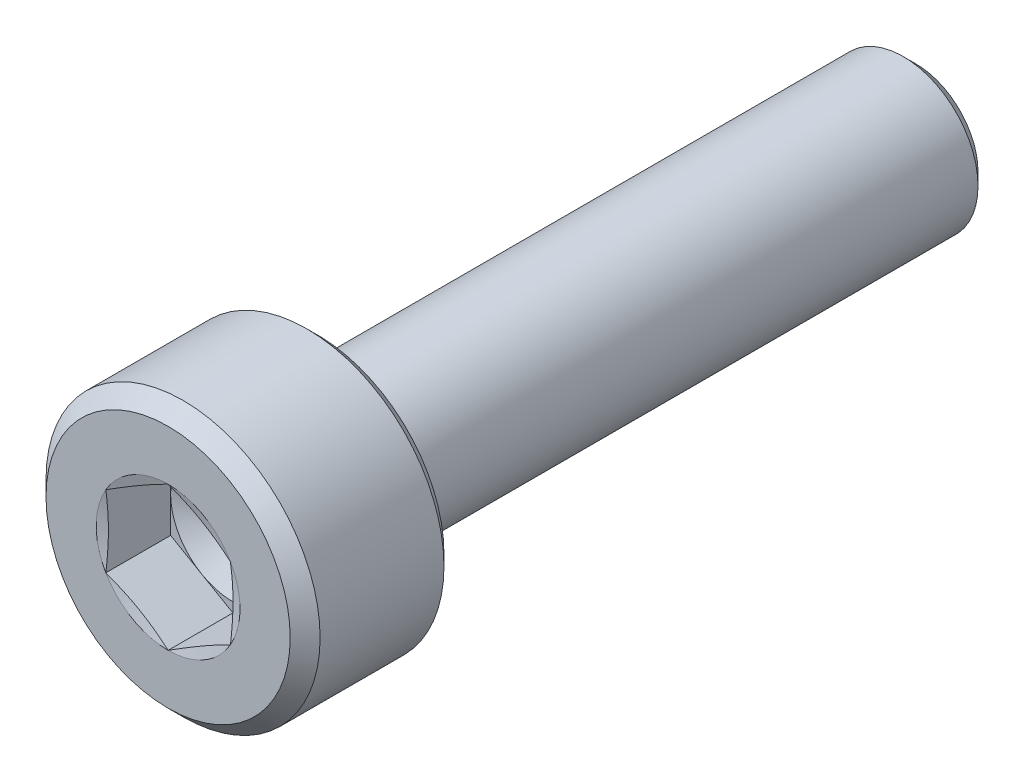
ISO-10303-21;
HEADER;
FILE_DESCRIPTION(('STEP AP214'),'2;1');
FILE_NAME('part.step','',(''),(''),'','','');
FILE_SCHEMA(('AUTOMOTIVE_DESIGN { 1 0 10303 214 1 1 1 1 }'));
ENDSEC;
DATA;
#1=APPLICATION_CONTEXT('core data for automotive mechanical design processes');
#2=APPLICATION_PROTOCOL_DEFINITION('international standard','automotive_design',2000,#1);
#3=PRODUCT_CONTEXT('',#1,'mechanical');
#4=PRODUCT('Part','Part','',(#3));
#5=PRODUCT_RELATED_PRODUCT_CATEGORY('part','',(#4));
#6=PRODUCT_DEFINITION_FORMATION('','',#4);
#7=PRODUCT_DEFINITION_CONTEXT('part definition',#1,'design');
#8=PRODUCT_DEFINITION('design','',#6,#7);
#9=PRODUCT_DEFINITION_SHAPE('','',#8);
#10=(LENGTH_UNIT() NAMED_UNIT(*) SI_UNIT(.MILLI.,.METRE.));
#11=(NAMED_UNIT(*) PLANE_ANGLE_UNIT() SI_UNIT($,.RADIAN.));
#12=(NAMED_UNIT(*) SI_UNIT($,.STERADIAN.) SOLID_ANGLE_UNIT());
#13=UNCERTAINTY_MEASURE_WITH_UNIT(LENGTH_MEASURE(1.E-05),#10,'distance_accuracy_value','');
#14=(GEOMETRIC_REPRESENTATION_CONTEXT(3) GLOBAL_UNCERTAINTY_ASSIGNED_CONTEXT((#13)) GLOBAL_UNIT_ASSIGNED_CONTEXT((#10,
#11,#12)) REPRESENTATION_CONTEXT('',''));
#15=CARTESIAN_POINT('',(0.,0.,0.));
#16=DIRECTION('',(0.,0.,1.));
#17=DIRECTION('',(1.,0.,0.));
#18=AXIS2_PLACEMENT_3D('',#15,#16,#17);
#19=CARTESIAN_POINT('',(0.,0.,0.));
#20=DIRECTION('',(0.,0.,-1.));
#21=DIRECTION('',(-1.,0.,0.));
#22=AXIS2_PLACEMENT_3D('',#19,#20,#21);
#23=PLANE('',#22);
#24=CARTESIAN_POINT('',(0.,0.,0.));
#25=DIRECTION('',(0.,0.,1.));
#26=DIRECTION('',(1.,0.,0.));
#27=AXIS2_PLACEMENT_3D('',#24,#25,#26);
#28=CIRCLE('',#27,2.44999999999999);
#29=CARTESIAN_POINT('',(2.44999999999999,0.,0.));
#30=VERTEX_POINT('',#29);
#31=EDGE_CURVE('E229',#30,#30,#28,.T.);
#32=ORIENTED_EDGE('',*,*,#31,.T.);
#33=EDGE_LOOP('',(#32));
#34=FACE_BOUND('',#33,.T.);
#35=CARTESIAN_POINT('',(0.,0.,0.));
#36=DIRECTION('',(0.,0.,1.));
#37=DIRECTION('',(1.,0.,0.));
#38=AXIS2_PLACEMENT_3D('',#35,#36,#37);
#39=CIRCLE('',#38,1.44337567297407);
#40=CARTESIAN_POINT('',(-1.25,-0.721687836487033,0.));
#41=VERTEX_POINT('',#40);
#42=CARTESIAN_POINT('',(0.,-1.44337567297407,0.));
#43=VERTEX_POINT('',#42);
#44=EDGE_CURVE('E155',#41,#43,#39,.T.);
#45=ORIENTED_EDGE('',*,*,#44,.F.);
#46=CARTESIAN_POINT('',(-1.25,0.721687836487033,0.));
#47=VERTEX_POINT('',#46);
#48=EDGE_CURVE('E154',#47,#41,#39,.T.);
#49=ORIENTED_EDGE('',*,*,#48,.F.);
#50=CARTESIAN_POINT('',(0.,1.44337567297407,0.));
#51=VERTEX_POINT('',#50);
#52=EDGE_CURVE('E121',#51,#47,#39,.T.);
#53=ORIENTED_EDGE('',*,*,#52,.F.);
#54=CARTESIAN_POINT('',(1.25,0.721687836487034,0.));
#55=VERTEX_POINT('',#54);
#56=EDGE_CURVE('E115',#55,#51,#39,.T.);
#57=ORIENTED_EDGE('',*,*,#56,.F.);
#58=CARTESIAN_POINT('',(1.25,-0.721687836487031,0.));
#59=VERTEX_POINT('',#58);
#60=EDGE_CURVE('E123',#59,#55,#39,.T.);
#61=ORIENTED_EDGE('',*,*,#60,.F.);
#62=EDGE_CURVE('E313',#43,#59,#39,.T.);
#63=ORIENTED_EDGE('',*,*,#62,.F.);
#64=EDGE_LOOP('',(#45,#49,#53,#57,#61,#63));
#65=FACE_BOUND('',#64,.T.);
#66=ADVANCED_FACE('F38',(#34,#65),#23,.F.);
#67=CARTESIAN_POINT('',(0.,0.,-0.3));
#68=DIRECTION('',(0.,0.,-1.));
#69=DIRECTION('',(-1.,0.,0.));
#70=AXIS2_PLACEMENT_3D('',#67,#68,#69);
#71=CONICAL_SURFACE('',#70,2.75,0.78539816339746);
#72=ORIENTED_EDGE('',*,*,#31,.F.);
#73=EDGE_LOOP('',(#72));
#74=FACE_BOUND('',#73,.T.);
#75=CARTESIAN_POINT('',(0.,0.,-0.3));
#76=DIRECTION('',(0.,0.,1.));
#77=DIRECTION('',(1.,0.,0.));
#78=AXIS2_PLACEMENT_3D('',#75,#76,#77);
#79=CIRCLE('',#78,2.75);
#80=CARTESIAN_POINT('',(2.75,0.,-0.3));
#81=VERTEX_POINT('',#80);
#82=EDGE_CURVE('E231',#81,#81,#79,.T.);
#83=ORIENTED_EDGE('',*,*,#82,.T.);
#84=EDGE_LOOP('',(#83));
#85=FACE_BOUND('',#84,.T.);
#86=ADVANCED_FACE('F220',(#74,#85),#71,.T.);
#87=CARTESIAN_POINT('',(0.,0.,0.));
#88=DIRECTION('',(0.,0.,1.));
#89=DIRECTION('',(1.,0.,0.));
#90=AXIS2_PLACEMENT_3D('',#87,#88,#89);
#91=CYLINDRICAL_SURFACE('',#90,2.75);
#92=ORIENTED_EDGE('',*,*,#82,.F.);
#93=EDGE_LOOP('',(#92));
#94=FACE_BOUND('',#93,.T.);
#95=CARTESIAN_POINT('',(0.,0.,-2.785));
#96=DIRECTION('',(0.,0.,1.));
#97=DIRECTION('',(1.,0.,0.));
#98=AXIS2_PLACEMENT_3D('',#95,#96,#97);
#99=CIRCLE('',#98,2.75);
#100=CARTESIAN_POINT('',(2.75,0.,-2.785));
#101=VERTEX_POINT('',#100);
#102=EDGE_CURVE('E234',#101,#101,#99,.T.);
#103=ORIENTED_EDGE('',*,*,#102,.T.);
#104=EDGE_LOOP('',(#103));
#105=FACE_BOUND('',#104,.T.);
#106=ADVANCED_FACE('F225',(#94,#105),#91,.T.);
#107=CARTESIAN_POINT('',(0.,0.,-3.));
#108=DIRECTION('',(0.,0.,1.));
#109=DIRECTION('',(1.,0.,0.));
#110=AXIS2_PLACEMENT_3D('',#107,#108,#109);
#111=CONICAL_SURFACE('',#110,2.535,0.785398163397449);
#112=ORIENTED_EDGE('',*,*,#102,.F.);
#113=EDGE_LOOP('',(#112));
#114=FACE_BOUND('',#113,.T.);
#115=CARTESIAN_POINT('',(0.,0.,-3.));
#116=DIRECTION('',(0.,0.,1.));
#117=DIRECTION('',(1.,0.,0.));
#118=AXIS2_PLACEMENT_3D('',#115,#116,#117);
#119=CIRCLE('',#118,2.535);
#120=CARTESIAN_POINT('',(2.535,0.,-3.));
#121=VERTEX_POINT('',#120);
#122=EDGE_CURVE('E239',#121,#121,#119,.T.);
#123=ORIENTED_EDGE('',*,*,#122,.T.);
#124=EDGE_LOOP('',(#123));
#125=FACE_BOUND('',#124,.T.);
#126=ADVANCED_FACE('F429',(#114,#125),#111,.T.);
#127=CARTESIAN_POINT('',(0.,2.535,-3.));
#128=DIRECTION('',(0.,0.,1.));
#129=DIRECTION('',(1.,0.,0.));
#130=AXIS2_PLACEMENT_3D('',#127,#128,#129);
#131=PLANE('',#130);
#132=ORIENTED_EDGE('',*,*,#122,.F.);
#133=EDGE_LOOP('',(#132));
#134=FACE_BOUND('',#133,.T.);
#135=CARTESIAN_POINT('',(0.,0.,-3.));
#136=DIRECTION('',(0.,0.,1.));
#137=DIRECTION('',(1.,0.,0.));
#138=AXIS2_PLACEMENT_3D('',#135,#136,#137);
#139=CIRCLE('',#138,1.8);
#140=CARTESIAN_POINT('',(1.8,0.,-3.));
#141=VERTEX_POINT('',#140);
#142=EDGE_CURVE('E242',#141,#141,#139,.T.);
#143=ORIENTED_EDGE('',*,*,#142,.T.);
#144=EDGE_LOOP('',(#143));
#145=FACE_BOUND('',#144,.T.);
#146=ADVANCED_FACE('F421',(#134,#145),#131,.F.);
#147=CARTESIAN_POINT('',(0.,0.,-3.1));
#148=DIRECTION('',(0.,0.,1.));
#149=DIRECTION('',(1.,0.,0.));
#150=AXIS2_PLACEMENT_3D('',#147,#148,#149);
#151=TOROIDAL_SURFACE('',#150,1.8,0.1);
#152=ORIENTED_EDGE('',*,*,#142,.F.);
#153=EDGE_LOOP('',(#152));
#154=FACE_BOUND('',#153,.T.);
#155=CARTESIAN_POINT('',(0.,0.,-3.05615763679786));
#156=DIRECTION('',(0.,0.,1.));
#157=DIRECTION('',(1.,0.,0.));
#158=AXIS2_PLACEMENT_3D('',#155,#156,#157);
#159=CIRCLE('',#158,1.71012315543561);
#160=CARTESIAN_POINT('',(1.71012315543561,0.,-3.05615763679786));
#161=VERTEX_POINT('',#160);
#162=EDGE_CURVE('E245',#161,#161,#159,.T.);
#163=ORIENTED_EDGE('',*,*,#162,.T.);
#164=EDGE_LOOP('',(#163));
#165=FACE_BOUND('',#164,.T.);
#166=ADVANCED_FACE('F413',(#154,#165),#151,.F.);
#167=CARTESIAN_POINT('',(0.,0.,-3.46615763679786));
#168=DIRECTION('',(0.,0.,1.));
#169=DIRECTION('',(1.,0.,0.));
#170=AXIS2_PLACEMENT_3D('',#167,#168,#169);
#171=CONICAL_SURFACE('',#170,1.51012315543561,0.453844001521511);
#172=ORIENTED_EDGE('',*,*,#162,.F.);
#173=EDGE_LOOP('',(#172));
#174=FACE_BOUND('',#173,.T.);
#175=CARTESIAN_POINT('',(0.,0.,-3.46615763679786));
#176=DIRECTION('',(0.,0.,1.));
#177=DIRECTION('',(1.,0.,0.));
#178=AXIS2_PLACEMENT_3D('',#175,#176,#177);
#179=CIRCLE('',#178,1.51012315543561);
#180=CARTESIAN_POINT('',(1.51012315543561,0.,-3.46615763679786));
#181=VERTEX_POINT('',#180);
#182=EDGE_CURVE('E248',#181,#181,#179,.T.);
#183=ORIENTED_EDGE('',*,*,#182,.T.);
#184=EDGE_LOOP('',(#183));
#185=FACE_BOUND('',#184,.T.);
#186=ADVANCED_FACE('F405',(#174,#185),#171,.T.);
#187=CARTESIAN_POINT('',(0.,0.,-3.51));
#188=DIRECTION('',(0.,0.,1.));
#189=DIRECTION('',(1.,0.,0.));
#190=AXIS2_PLACEMENT_3D('',#187,#188,#189);
#191=TOROIDAL_SURFACE('',#190,1.6,0.1);
#192=ORIENTED_EDGE('',*,*,#182,.F.);
#193=EDGE_LOOP('',(#192));
#194=FACE_BOUND('',#193,.T.);
#195=CARTESIAN_POINT('',(0.,0.,-3.51));
#196=DIRECTION('',(0.,0.,1.));
#197=DIRECTION('',(1.,0.,0.));
#198=AXIS2_PLACEMENT_3D('',#195,#196,#197);
#199=CIRCLE('',#198,1.5);
#200=CARTESIAN_POINT('',(1.5,0.,-3.51));
#201=VERTEX_POINT('',#200);
#202=EDGE_CURVE('E251',#201,#201,#199,.T.);
#203=ORIENTED_EDGE('',*,*,#202,.T.);
#204=EDGE_LOOP('',(#203));
#205=FACE_BOUND('',#204,.T.);
#206=ADVANCED_FACE('F397',(#194,#205),#191,.F.);
#207=CARTESIAN_POINT('',(0.,0.,0.));
#208=DIRECTION('',(0.,0.,1.));
#209=DIRECTION('',(1.,0.,0.));
#210=AXIS2_PLACEMENT_3D('',#207,#208,#209);
#211=CYLINDRICAL_SURFACE('',#210,1.5);
#212=ORIENTED_EDGE('',*,*,#202,.F.);
#213=EDGE_LOOP('',(#212));
#214=FACE_BOUND('',#213,.T.);
#215=CARTESIAN_POINT('',(0.,0.,-14.75));
#216=DIRECTION('',(0.,0.,1.));
#217=DIRECTION('',(1.,0.,0.));
#218=AXIS2_PLACEMENT_3D('',#215,#216,#217);
#219=CIRCLE('',#218,1.5);
#220=CARTESIAN_POINT('',(1.5,0.,-14.75));
#221=VERTEX_POINT('',#220);
#222=EDGE_CURVE('E254',#221,#221,#219,.T.);
#223=ORIENTED_EDGE('',*,*,#222,.T.);
#224=EDGE_LOOP('',(#223));
#225=FACE_BOUND('',#224,.T.);
#226=ADVANCED_FACE('F388',(#214,#225),#211,.T.);
#227=CARTESIAN_POINT('',(0.,0.,-15.));
#228=DIRECTION('',(0.,0.,1.));
#229=DIRECTION('',(1.,0.,0.));
#230=AXIS2_PLACEMENT_3D('',#227,#228,#229);
#231=CONICAL_SURFACE('',#230,1.25,0.785398163397434);
#232=ORIENTED_EDGE('',*,*,#222,.F.);
#233=EDGE_LOOP('',(#232));
#234=FACE_BOUND('',#233,.T.);
#235=CARTESIAN_POINT('',(0.,0.,-15.));
#236=DIRECTION('',(0.,0.,1.));
#237=DIRECTION('',(1.,0.,0.));
#238=AXIS2_PLACEMENT_3D('',#235,#236,#237);
#239=CIRCLE('',#238,1.25);
#240=CARTESIAN_POINT('',(1.25,0.,-15.));
#241=VERTEX_POINT('',#240);
#242=EDGE_CURVE('E257',#241,#241,#239,.T.);
#243=ORIENTED_EDGE('',*,*,#242,.T.);
#244=EDGE_LOOP('',(#243));
#245=FACE_BOUND('',#244,.T.);
#246=ADVANCED_FACE('F380',(#234,#245),#231,.T.);
#247=CARTESIAN_POINT('',(0.,1.25,-15.));
#248=DIRECTION('',(0.,0.,1.));
#249=DIRECTION('',(1.,0.,0.));
#250=AXIS2_PLACEMENT_3D('',#247,#248,#249);
#251=PLANE('',#250);
#252=ORIENTED_EDGE('',*,*,#242,.F.);
#253=EDGE_LOOP('',(#252));
#254=FACE_BOUND('',#253,.T.);
#255=ADVANCED_FACE('F374',(#254),#251,.F.);
#256=CARTESIAN_POINT('',(0.,0.,-0.0518148554092243));
#257=DIRECTION('',(0.,0.,1.));
#258=DIRECTION('',(1.,0.,0.));
#259=AXIS2_PLACEMENT_3D('',#256,#257,#258);
#260=CONICAL_SURFACE('',#259,1.25,1.30899693899575);
#261=ORIENTED_EDGE('',*,*,#52,.T.);
#262=CARTESIAN_POINT('',(-1.2502,0.721572366433195,3.09438201916871E-05));
#263=CARTESIAN_POINT('',(-1.19827409383526,0.751551802335321,-0.00800698378926622));
#264=CARTESIAN_POINT('',(-1.14625401362102,0.781585609650283,-0.0153042105125454));
#265=CARTESIAN_POINT('',(-1.04203006351459,0.841759335300235,-0.0281248924452036));
#266=CARTESIAN_POINT('',(-0.989826127596593,0.871899291755248,-0.0336476265269101));
#267=CARTESIAN_POINT('',(-0.88555111655682,0.932102497448812,-0.0425967858491088));
#268=CARTESIAN_POINT('',(-0.833480747184869,0.962165339222511,-0.0460338877791617));
#269=CARTESIAN_POINT('',(-0.729273575326724,1.0223293779463,-0.0506427032068));
#270=CARTESIAN_POINT('',(-0.677136787663362,1.05243056633842,-0.0518148554092241));
#271=CARTESIAN_POINT('',(-0.572863212336638,1.11263294312267,-0.0518148554092241));
#272=CARTESIAN_POINT('',(-0.520726424673275,1.1427341315148,-0.0506427032068001));
#273=CARTESIAN_POINT('',(-0.416519252815131,1.20289817023859,-0.0460338877791617));
#274=CARTESIAN_POINT('',(-0.36444888344318,1.23296101201229,-0.0425967858491088));
#275=CARTESIAN_POINT('',(-0.260173872403407,1.29316421770585,-0.03364762652691));
#276=CARTESIAN_POINT('',(-0.207969936485411,1.32330417416086,-0.0281248924452036));
#277=CARTESIAN_POINT('',(-0.103745986378985,1.38347789981082,-0.0153042105125453));
#278=CARTESIAN_POINT('',(-0.0517259061647358,1.41351170712578,-0.00800698378926612));
#279=CARTESIAN_POINT('',(0.00020000000000038,1.4434911430279,3.09438201918299E-05));
#280=B_SPLINE_CURVE_WITH_KNOTS('',3,(#262,#263,#264,#265,#266,#267,#268,#269,#270,#271,#272,
#273,#274,#275,#276,#277,#278,#279),.UNSPECIFIED.,.F.,.F.,(4,2,2,2,2,2,2,2,4),(0.,
0.18149525192516,0.363064167833313,0.543695584294992,0.724292010212745,0.9048884361305,
1.08551985259218,1.26708876850033,1.44858402042549),.UNSPECIFIED.);
#281=EDGE_CURVE('E11',#47,#51,#280,.T.);
#282=ORIENTED_EDGE('',*,*,#281,.T.);
#283=EDGE_LOOP('',(#261,#282));
#284=FACE_BOUND('',#283,.T.);
#285=ADVANCED_FACE('F127',(#284),#260,.F.);
#286=CARTESIAN_POINT('',(-1.25,-1.90803764372689,0.224449375411132));
#287=CARTESIAN_POINT('',(-1.25,-1.8513410457493,0.21174373926854));
#288=CARTESIAN_POINT('',(-1.25,-1.79460907964503,0.199195804458375));
#289=CARTESIAN_POINT('',(-1.25,-1.68105673477474,0.174495010900465));
#290=CARTESIAN_POINT('',(-1.25,-1.62423635229394,0.162342169249333));
#291=CARTESIAN_POINT('',(-1.25,-1.4535135757121,0.126574423752231));
#292=CARTESIAN_POINT('',(-1.25,-1.33945900339908,0.103675151182616));
#293=CARTESIAN_POINT('',(-1.25,-1.11170727260793,0.0609587630346281));
#294=CARTESIAN_POINT('',(-1.25,-0.998014548362105,0.0411184667683871));
#295=CARTESIAN_POINT('',(-1.25,-0.769948454688276,0.00583266905587686));
#296=CARTESIAN_POINT('',(-1.25,-0.655575207287998,-0.00961359741797872));
#297=CARTESIAN_POINT('',(-1.25,-0.424787181644499,-0.0341426384914952));
#298=CARTESIAN_POINT('',(-1.25,-0.308363938645654,-0.0431515305449703));
#299=CARTESIAN_POINT('',(-1.25,-0.133499226938177,-0.0502674214127566));
#300=CARTESIAN_POINT('',(-1.25,-0.0751823293286765,-0.0515734559811251));
#301=CARTESIAN_POINT('',(-1.25,0.0414593912908041,-0.0519953132862497));
#302=CARTESIAN_POINT('',(-1.25,0.0997842142946219,-0.0511111377164467));
#303=CARTESIAN_POINT('',(-1.25,0.275064939261687,-0.0452058780708578));
#304=CARTESIAN_POINT('',(-1.25,0.391917619612776,-0.0369155048717787));
#305=CARTESIAN_POINT('',(-1.25,0.624955711707257,-0.013420604100275));
#306=CARTESIAN_POINT('',(-1.25,0.741140574853819,0.00178895996036897));
#307=CARTESIAN_POINT('',(-1.25,0.965009686747211,0.0357098573203466));
#308=CARTESIAN_POINT('',(-1.25,1.07274149713457,0.0541179629895213));
#309=CARTESIAN_POINT('',(-1.25,1.28770836040789,0.0936619087242774));
#310=CARTESIAN_POINT('',(-1.25,1.39494334881407,0.114798093117207));
#311=CARTESIAN_POINT('',(-1.25,1.60905523406172,0.158897571848756));
#312=CARTESIAN_POINT('',(-1.25,1.71593205434096,0.181861233731142));
#313=CARTESIAN_POINT('',(-1.25,1.92941059122614,0.229035853527515));
#314=CARTESIAN_POINT('',(-1.25,2.0360123020935,0.253246837242345));
#315=CARTESIAN_POINT('',(-1.25,2.24796149236902,0.302300913060499));
#316=CARTESIAN_POINT('',(-1.25,2.35331096915779,0.32713541151495));
#317=CARTESIAN_POINT('',(-1.25,2.56386296226419,0.377426560036597));
#318=CARTESIAN_POINT('',(-1.25,2.66906547587909,0.402883221390532));
#319=CARTESIAN_POINT('',(-1.25,2.87922866754162,0.454224569867166));
#320=CARTESIAN_POINT('',(-1.25,2.98418948388924,0.4801086920956));
#321=CARTESIAN_POINT('',(-1.25,3.19401964928918,0.53223064686748));
#322=CARTESIAN_POINT('',(-1.25,3.29888900123911,0.558468467737611));
#323=CARTESIAN_POINT('',(-1.25,3.40372646605654,0.5848316076134));
#324=B_SPLINE_CURVE_WITH_KNOTS('',3,(#286,#287,#288,#289,#290,#291,#292,#293,#294,#295,#296,
#297,#298,#299,#300,#301,#302,#303,#304,#305,#306,#307,#308,#309,#310,#311,#312,#313,#314,#315,
#316,#317,#318,#319,#320,#321,#322,#323),.UNSPECIFIED.,.F.,.F.,(4,2,2,2,2,2,2,2,2,2,2,2,2,2,2,2,
2,2,4),(0.,0.17430798332962,0.348623499364559,0.697591208701206,1.04376859165833,
1.38988566606611,1.73991400543005,1.91487041156219,2.08982668242046,2.44096537417444,
2.79236007022679,3.12019018011378,3.44806170796195,3.77599934506425,4.10394376827983,
4.4286525086615,4.75336714400545,5.07768244044904,5.40198705941089),.UNSPECIFIED.);
#325=EDGE_CURVE('E120',#41,#47,#324,.T.);
#326=ORIENTED_EDGE('',*,*,#325,.T.);
#327=ORIENTED_EDGE('',*,*,#48,.T.);
#328=EDGE_LOOP('',(#326,#327));
#329=FACE_BOUND('',#328,.T.);
#330=ADVANCED_FACE('F361',(#329),#260,.F.);
#331=CARTESIAN_POINT('',(0.000199999999999765,-1.4434911430279,3.09438201913897E-05));
#332=CARTESIAN_POINT('',(-0.0517259061647364,-1.41351170712578,-0.0080069837892665));
#333=CARTESIAN_POINT('',(-0.103745986378985,-1.38347789981081,-0.0153042105125457));
#334=CARTESIAN_POINT('',(-0.207969936485412,-1.32330417416086,-0.028124892445204));
#335=CARTESIAN_POINT('',(-0.260173872403408,-1.29316421770585,-0.0336476265269104));
#336=CARTESIAN_POINT('',(-0.36444888344318,-1.23296101201229,-0.0425967858491091));
#337=CARTESIAN_POINT('',(-0.416519252815131,-1.20289817023859,-0.046033887779162));
#338=CARTESIAN_POINT('',(-0.520726424673276,-1.1427341315148,-0.0506427032068003));
#339=CARTESIAN_POINT('',(-0.572863212336638,-1.11263294312267,-0.0518148554092244));
#340=CARTESIAN_POINT('',(-0.677136787663362,-1.05243056633842,-0.0518148554092244));
#341=CARTESIAN_POINT('',(-0.729273575326725,-1.0223293779463,-0.0506427032068003));
#342=CARTESIAN_POINT('',(-0.833480747184869,-0.962165339222509,-0.046033887779162));
#343=CARTESIAN_POINT('',(-0.88555111655682,-0.93210249744881,-0.0425967858491091));
#344=CARTESIAN_POINT('',(-0.989826127596593,-0.871899291755246,-0.0336476265269103));
#345=CARTESIAN_POINT('',(-1.04203006351459,-0.841759335300233,-0.0281248924452038));
#346=CARTESIAN_POINT('',(-1.14625401362102,-0.781585609650282,-0.0153042105125455));
#347=CARTESIAN_POINT('',(-1.19827409383526,-0.75155180233532,-0.00800698378926632));
#348=CARTESIAN_POINT('',(-1.2502,-0.721572366433194,3.09438201915463E-05));
#349=B_SPLINE_CURVE_WITH_KNOTS('',3,(#331,#332,#333,#334,#335,#336,#337,#338,#339,#340,#341,
#342,#343,#344,#345,#346,#347,#348),.UNSPECIFIED.,.F.,.F.,(4,2,2,2,2,2,2,2,4),(0.,
0.18149525192516,0.363064167833313,0.543695584294991,0.724292010212745,0.904888436130499,
1.08551985259218,1.26708876850033,1.44858402042549),.UNSPECIFIED.);
#350=EDGE_CURVE('E163',#43,#41,#349,.T.);
#351=ORIENTED_EDGE('',*,*,#350,.T.);
#352=ORIENTED_EDGE('',*,*,#44,.T.);
#353=EDGE_LOOP('',(#351,#352));
#354=FACE_BOUND('',#353,.T.);
#355=ADVANCED_FACE('F355',(#354),#260,.F.);
#356=CARTESIAN_POINT('',(1.2502,-0.721572366433195,3.09438201914613E-05));
#357=CARTESIAN_POINT('',(1.19827409383526,-0.75155180233532,-0.00800698378926647));
#358=CARTESIAN_POINT('',(1.14625401362101,-0.781585609650283,-0.0153042105125457));
#359=CARTESIAN_POINT('',(1.04203006351459,-0.841759335300234,-0.0281248924452039));
#360=CARTESIAN_POINT('',(0.989826127596592,-0.871899291755247,-0.0336476265269103));
#361=CARTESIAN_POINT('',(0.88555111655682,-0.932102497448811,-0.042596785849109));
#362=CARTESIAN_POINT('',(0.833480747184869,-0.96216533922251,-0.046033887779162));
#363=CARTESIAN_POINT('',(0.729273575326724,-1.0223293779463,-0.0506427032068003));
#364=CARTESIAN_POINT('',(0.677136787663362,-1.05243056633842,-0.0518148554092244));
#365=CARTESIAN_POINT('',(0.572863212336637,-1.11263294312267,-0.0518148554092244));
#366=CARTESIAN_POINT('',(0.520726424673275,-1.1427341315148,-0.0506427032068003));
#367=CARTESIAN_POINT('',(0.416519252815131,-1.20289817023859,-0.046033887779162));
#368=CARTESIAN_POINT('',(0.36444888344318,-1.23296101201229,-0.042596785849109));
#369=CARTESIAN_POINT('',(0.260173872403407,-1.29316421770585,-0.0336476265269103));
#370=CARTESIAN_POINT('',(0.207969936485411,-1.32330417416086,-0.028124892445204));
#371=CARTESIAN_POINT('',(0.103745986378985,-1.38347789981081,-0.0153042105125458));
#372=CARTESIAN_POINT('',(0.0517259061647362,-1.41351170712578,-0.00800698378926656));
#373=CARTESIAN_POINT('',(-0.000200000000000036,-1.4434911430279,3.09438201914066E-05));
#374=B_SPLINE_CURVE_WITH_KNOTS('',3,(#356,#357,#358,#359,#360,#361,#362,#363,#364,#365,#366,
#367,#368,#369,#370,#371,#372,#373),.UNSPECIFIED.,.F.,.F.,(4,2,2,2,2,2,2,2,4),(0.,
0.18149525192516,0.363064167833312,0.543695584294991,0.724292010212745,0.904888436130499,
1.08551985259218,1.26708876850033,1.44858402042549),.UNSPECIFIED.);
#375=EDGE_CURVE('E183',#59,#43,#374,.T.);
#376=ORIENTED_EDGE('',*,*,#375,.T.);
#377=ORIENTED_EDGE('',*,*,#62,.T.);
#378=EDGE_LOOP('',(#376,#377));
#379=FACE_BOUND('',#378,.T.);
#380=ADVANCED_FACE('F349',(#379),#260,.F.);
#381=CARTESIAN_POINT('',(1.25,-1.90803764372689,0.224449375411132));
#382=CARTESIAN_POINT('',(1.25,-1.8513410457493,0.21174373926854));
#383=CARTESIAN_POINT('',(1.25,-1.79460907964503,0.199195804458375));
#384=CARTESIAN_POINT('',(1.25,-1.68105673477474,0.174495010900465));
#385=CARTESIAN_POINT('',(1.25,-1.62423635229394,0.162342169249333));
#386=CARTESIAN_POINT('',(1.25,-1.4535135757121,0.126574423752231));
#387=CARTESIAN_POINT('',(1.25,-1.33945900339908,0.103675151182616));
#388=CARTESIAN_POINT('',(1.25,-1.11170727260793,0.0609587630346278));
#389=CARTESIAN_POINT('',(1.25,-0.998014548362105,0.0411184667683869));
#390=CARTESIAN_POINT('',(1.25,-0.769948454688276,0.00583266905587672));
#391=CARTESIAN_POINT('',(1.25,-0.655575207287999,-0.00961359741797884));
#392=CARTESIAN_POINT('',(1.25,-0.4247871816445,-0.0341426384914953));
#393=CARTESIAN_POINT('',(1.25,-0.308363938645655,-0.0431515305449704));
#394=CARTESIAN_POINT('',(1.25,-0.133499226938178,-0.0502674214127568));
#395=CARTESIAN_POINT('',(1.25,-0.0751823293286781,-0.0515734559811252));
#396=CARTESIAN_POINT('',(1.25,0.0414593912908024,-0.0519953132862499));
#397=CARTESIAN_POINT('',(1.25,0.0997842142946203,-0.0511111377164469));
#398=CARTESIAN_POINT('',(1.25,0.275064939261685,-0.045205878070858));
#399=CARTESIAN_POINT('',(1.25,0.391917619612775,-0.036915504871779));
#400=CARTESIAN_POINT('',(1.25,0.624955711707256,-0.0134206041002753));
#401=CARTESIAN_POINT('',(1.25,0.741140574853817,0.00178895996036867));
#402=CARTESIAN_POINT('',(1.25,0.96500968674721,0.0357098573203462));
#403=CARTESIAN_POINT('',(1.25,1.07274149713457,0.054117962989521));
#404=CARTESIAN_POINT('',(1.25,1.28770836040789,0.093661908724277));
#405=CARTESIAN_POINT('',(1.25,1.39494334881407,0.114798093117207));
#406=CARTESIAN_POINT('',(1.25,1.60905523406172,0.158897571848756));
#407=CARTESIAN_POINT('',(1.25,1.71593205434096,0.181861233731142));
#408=CARTESIAN_POINT('',(1.25,1.92941059122614,0.229035853527516));
#409=CARTESIAN_POINT('',(1.25,2.0360123020935,0.253246837242345));
#410=CARTESIAN_POINT('',(1.25,2.24796149236902,0.302300913060499));
#411=CARTESIAN_POINT('',(1.25,2.35331096915779,0.32713541151495));
#412=CARTESIAN_POINT('',(1.25,2.56386296226419,0.377426560036597));
#413=CARTESIAN_POINT('',(1.25,2.66906547587909,0.402883221390532));
#414=CARTESIAN_POINT('',(1.25,2.87922866754162,0.454224569867166));
#415=CARTESIAN_POINT('',(1.25,2.98418948388924,0.4801086920956));
#416=CARTESIAN_POINT('',(1.25,3.19401964928918,0.53223064686748));
#417=CARTESIAN_POINT('',(1.25,3.29888900123911,0.558468467737611));
#418=CARTESIAN_POINT('',(1.25,3.40372646605654,0.5848316076134));
#419=B_SPLINE_CURVE_WITH_KNOTS('',3,(#381,#382,#383,#384,#385,#386,#387,#388,#389,#390,#391,
#392,#393,#394,#395,#396,#397,#398,#399,#400,#401,#402,#403,#404,#405,#406,#407,#408,#409,#410,
#411,#412,#413,#414,#415,#416,#417,#418),.UNSPECIFIED.,.F.,.F.,(4,2,2,2,2,2,2,2,2,2,2,2,2,2,2,2,
2,2,4),(0.,0.17430798332962,0.348623499364559,0.697591208701206,1.04376859165833,
1.38988566606611,1.73991400543005,1.91487041156219,2.08982668242046,2.44096537417444,
2.79236007022679,3.12019018011378,3.44806170796195,3.77599934506425,4.10394376827983,
4.4286525086615,4.75336714400545,5.07768244044904,5.40198705941089),.UNSPECIFIED.);
#420=EDGE_CURVE('E63',#55,#59,#419,.F.);
#421=ORIENTED_EDGE('',*,*,#420,.T.);
#422=ORIENTED_EDGE('',*,*,#60,.T.);
#423=EDGE_LOOP('',(#421,#422));
#424=FACE_BOUND('',#423,.T.);
#425=ADVANCED_FACE('F176',(#424),#260,.F.);
#426=CARTESIAN_POINT('',(-0.000199999999999885,1.4434911430279,3.09438201917452E-05));
#427=CARTESIAN_POINT('',(0.0517259061647365,1.41351170712578,-0.00800698378926616));
#428=CARTESIAN_POINT('',(0.103745986378985,1.38347789981081,-0.0153042105125454));
#429=CARTESIAN_POINT('',(0.207969936485411,1.32330417416086,-0.0281248924452036));
#430=CARTESIAN_POINT('',(0.260173872403408,1.29316421770585,-0.03364762652691));
#431=CARTESIAN_POINT('',(0.36444888344318,1.23296101201229,-0.0425967858491087));
#432=CARTESIAN_POINT('',(0.416519252815131,1.20289817023859,-0.0460338877791617));
#433=CARTESIAN_POINT('',(0.520726424673275,1.1427341315148,-0.0506427032068));
#434=CARTESIAN_POINT('',(0.572863212336638,1.11263294312267,-0.0518148554092241));
#435=CARTESIAN_POINT('',(0.677136787663362,1.05243056633842,-0.0518148554092242));
#436=CARTESIAN_POINT('',(0.729273575326724,1.0223293779463,-0.0506427032068001));
#437=CARTESIAN_POINT('',(0.833480747184869,0.962165339222511,-0.0460338877791617));
#438=CARTESIAN_POINT('',(0.88555111655682,0.932102497448812,-0.0425967858491088));
#439=CARTESIAN_POINT('',(0.989826127596592,0.871899291755248,-0.0336476265269101));
#440=CARTESIAN_POINT('',(1.04203006351459,0.841759335300235,-0.0281248924452037));
#441=CARTESIAN_POINT('',(1.14625401362101,0.781585609650283,-0.0153042105125454));
#442=CARTESIAN_POINT('',(1.19827409383526,0.751551802335321,-0.00800698378926624));
#443=CARTESIAN_POINT('',(1.2502,0.721572366433195,3.09438201916591E-05));
#444=B_SPLINE_CURVE_WITH_KNOTS('',3,(#426,#427,#428,#429,#430,#431,#432,#433,#434,#435,#436,
#437,#438,#439,#440,#441,#442,#443),.UNSPECIFIED.,.F.,.F.,(4,2,2,2,2,2,2,2,4),(0.,
0.18149525192516,0.363064167833313,0.543695584294991,0.724292010212745,0.904888436130499,
1.08551985259218,1.26708876850033,1.44858402042549),.UNSPECIFIED.);
#445=EDGE_CURVE('E57',#51,#55,#444,.T.);
#446=ORIENTED_EDGE('',*,*,#445,.T.);
#447=ORIENTED_EDGE('',*,*,#56,.T.);
#448=EDGE_LOOP('',(#446,#447));
#449=FACE_BOUND('',#448,.T.);
#450=ADVANCED_FACE('F116',(#449),#260,.F.);
#451=CARTESIAN_POINT('',(0.,0.,-2.02168783648703));
#452=DIRECTION('',(0.,0.,1.));
#453=DIRECTION('',(1.,0.,0.));
#454=AXIS2_PLACEMENT_3D('',#451,#452,#453);
#455=CONICAL_SURFACE('',#454,0.,1.0471975511966);
#456=CARTESIAN_POINT('',(0.,0.,-1.3));
#457=DIRECTION('',(0.,0.,1.));
#458=DIRECTION('',(1.,0.,0.));
#459=AXIS2_PLACEMENT_3D('',#456,#457,#458);
#460=CIRCLE('',#459,1.25);
#461=CARTESIAN_POINT('',(1.25,0.,-1.3));
#462=VERTEX_POINT('',#461);
#463=CARTESIAN_POINT('',(0.625,1.08253175473055,-1.3));
#464=VERTEX_POINT('',#463);
#465=EDGE_CURVE('E143',#462,#464,#460,.T.);
#466=ORIENTED_EDGE('',*,*,#465,.T.);
#467=CARTESIAN_POINT('',(-0.625,1.08253175473055,-1.3));
#468=VERTEX_POINT('',#467);
#469=EDGE_CURVE('E51',#464,#468,#460,.T.);
#470=ORIENTED_EDGE('',*,*,#469,.T.);
#471=CARTESIAN_POINT('',(-1.25,0.,-1.3));
#472=VERTEX_POINT('',#471);
#473=EDGE_CURVE('E294',#468,#472,#460,.T.);
#474=ORIENTED_EDGE('',*,*,#473,.T.);
#475=CARTESIAN_POINT('',(-0.625,-1.08253175473055,-1.3));
#476=VERTEX_POINT('',#475);
#477=EDGE_CURVE('E296',#472,#476,#460,.T.);
#478=ORIENTED_EDGE('',*,*,#477,.T.);
#479=CARTESIAN_POINT('',(0.624999999999999,-1.08253175473055,-1.3));
#480=VERTEX_POINT('',#479);
#481=EDGE_CURVE('E232',#476,#480,#460,.T.);
#482=ORIENTED_EDGE('',*,*,#481,.T.);
#483=EDGE_CURVE('E230',#480,#462,#460,.T.);
#484=ORIENTED_EDGE('',*,*,#483,.T.);
#485=EDGE_LOOP('',(#466,#470,#474,#478,#482,#484));
#486=FACE_BOUND('',#485,.T.);
#487=CARTESIAN_POINT('',(0.,0.,-2.02168783648703));
#488=VERTEX_POINT('',#487);
#489=VERTEX_LOOP('',#488);
#490=FACE_BOUND('',#489,.T.);
#491=ADVANCED_FACE('F175',(#486,#490),#455,.F.);
#492=CARTESIAN_POINT('',(0.,0.,-1.3));
#493=DIRECTION('',(0.,0.,1.));
#494=DIRECTION('',(1.,0.,0.));
#495=AXIS2_PLACEMENT_3D('',#492,#493,#494);
#496=PLANE('',#495);
#497=ORIENTED_EDGE('',*,*,#465,.F.);
#498=DIRECTION('',(0.,1.,0.));
#499=VECTOR('',#498,1.);
#500=CARTESIAN_POINT('',(1.25,-0.721687836487033,-1.3));
#501=LINE('',#500,#499);
#502=CARTESIAN_POINT('',(1.25,0.721687836487033,-1.3));
#503=VERTEX_POINT('',#502);
#504=EDGE_CURVE('E273',#462,#503,#501,.T.);
#505=ORIENTED_EDGE('',*,*,#504,.T.);
#506=DIRECTION('',(-0.866025403784439,0.5,0.));
#507=VECTOR('',#506,1.);
#508=CARTESIAN_POINT('',(1.25,0.721687836487033,-1.3));
#509=LINE('',#508,#507);
#510=EDGE_CURVE('E288',#503,#464,#509,.T.);
#511=ORIENTED_EDGE('',*,*,#510,.T.);
#512=EDGE_LOOP('',(#497,#505,#511));
#513=FACE_BOUND('',#512,.T.);
#514=ADVANCED_FACE('F318',(#513),#496,.T.);
#515=ORIENTED_EDGE('',*,*,#483,.F.);
#516=DIRECTION('',(0.866025403784439,0.5,0.));
#517=VECTOR('',#516,1.);
#518=CARTESIAN_POINT('',(0.,-1.44337567297406,-1.3));
#519=LINE('',#518,#517);
#520=CARTESIAN_POINT('',(1.25,-0.721687836487033,-1.3));
#521=VERTEX_POINT('',#520);
#522=EDGE_CURVE('E277',#480,#521,#519,.T.);
#523=ORIENTED_EDGE('',*,*,#522,.T.);
#524=EDGE_CURVE('E150',#521,#462,#501,.T.);
#525=ORIENTED_EDGE('',*,*,#524,.T.);
#526=EDGE_LOOP('',(#515,#523,#525));
#527=FACE_BOUND('',#526,.T.);
#528=ADVANCED_FACE('F206',(#527),#496,.T.);
#529=ORIENTED_EDGE('',*,*,#481,.F.);
#530=DIRECTION('',(0.866025403784439,-0.5,0.));
#531=VECTOR('',#530,1.);
#532=CARTESIAN_POINT('',(-1.25,-0.721687836487032,-1.3));
#533=LINE('',#532,#531);
#534=CARTESIAN_POINT('',(0.,-1.44337567297406,-1.3));
#535=VERTEX_POINT('',#534);
#536=EDGE_CURVE('E281',#476,#535,#533,.T.);
#537=ORIENTED_EDGE('',*,*,#536,.T.);
#538=EDGE_CURVE('E274',#535,#480,#519,.T.);
#539=ORIENTED_EDGE('',*,*,#538,.T.);
#540=EDGE_LOOP('',(#529,#537,#539));
#541=FACE_BOUND('',#540,.T.);
#542=ADVANCED_FACE('F309',(#541),#496,.T.);
#543=ORIENTED_EDGE('',*,*,#477,.F.);
#544=DIRECTION('',(0.,-1.,0.));
#545=VECTOR('',#544,1.);
#546=CARTESIAN_POINT('',(-1.25,0.721687836487033,-1.3));
#547=LINE('',#546,#545);
#548=CARTESIAN_POINT('',(-1.25,-0.721687836487032,-1.3));
#549=VERTEX_POINT('',#548);
#550=EDGE_CURVE('E285',#472,#549,#547,.T.);
#551=ORIENTED_EDGE('',*,*,#550,.T.);
#552=EDGE_CURVE('E278',#549,#476,#533,.T.);
#553=ORIENTED_EDGE('',*,*,#552,.T.);
#554=EDGE_LOOP('',(#543,#551,#553));
#555=FACE_BOUND('',#554,.T.);
#556=ADVANCED_FACE('F323',(#555),#496,.T.);
#557=ORIENTED_EDGE('',*,*,#469,.F.);
#558=CARTESIAN_POINT('',(0.,1.44337567297407,-1.3));
#559=VERTEX_POINT('',#558);
#560=EDGE_CURVE('E290',#464,#559,#509,.T.);
#561=ORIENTED_EDGE('',*,*,#560,.T.);
#562=DIRECTION('',(-0.866025403784439,-0.5,0.));
#563=VECTOR('',#562,1.);
#564=CARTESIAN_POINT('',(0.,1.44337567297407,-1.3));
#565=LINE('',#564,#563);
#566=EDGE_CURVE('E148',#559,#468,#565,.T.);
#567=ORIENTED_EDGE('',*,*,#566,.T.);
#568=EDGE_LOOP('',(#557,#561,#567));
#569=FACE_BOUND('',#568,.T.);
#570=ADVANCED_FACE('F320',(#569),#496,.T.);
#571=ORIENTED_EDGE('',*,*,#473,.F.);
#572=CARTESIAN_POINT('',(-1.25,0.721687836487033,-1.3));
#573=VERTEX_POINT('',#572);
#574=EDGE_CURVE('E287',#468,#573,#565,.T.);
#575=ORIENTED_EDGE('',*,*,#574,.T.);
#576=EDGE_CURVE('E282',#573,#472,#547,.T.);
#577=ORIENTED_EDGE('',*,*,#576,.T.);
#578=EDGE_LOOP('',(#571,#575,#577));
#579=FACE_BOUND('',#578,.T.);
#580=ADVANCED_FACE('F322',(#579),#496,.T.);
#581=CARTESIAN_POINT('',(0.,1.44337567297407,-1.3));
#582=DIRECTION('',(-0.5,0.866025403784439,0.));
#583=DIRECTION('',(-0.866025403784439,-0.5,0.));
#584=AXIS2_PLACEMENT_3D('',#581,#582,#583);
#585=PLANE('',#584);
#586=ORIENTED_EDGE('',*,*,#281,.F.);
#587=DIRECTION('',(0.,0.,1.));
#588=VECTOR('',#587,1.);
#589=CARTESIAN_POINT('',(-1.25,0.721687836487033,-1.3));
#590=LINE('',#589,#588);
#591=EDGE_CURVE('E149',#573,#47,#590,.T.);
#592=ORIENTED_EDGE('',*,*,#591,.F.);
#593=ORIENTED_EDGE('',*,*,#574,.F.);
#594=ORIENTED_EDGE('',*,*,#566,.F.);
#595=DIRECTION('',(0.,0.,1.));
#596=VECTOR('',#595,1.);
#597=CARTESIAN_POINT('',(0.,1.44337567297407,-1.3));
#598=LINE('',#597,#596);
#599=EDGE_CURVE('E138',#559,#51,#598,.T.);
#600=ORIENTED_EDGE('',*,*,#599,.T.);
#601=EDGE_LOOP('',(#586,#592,#593,#594,#600));
#602=FACE_BOUND('',#601,.T.);
#603=ADVANCED_FACE('F145',(#602),#585,.F.);
#604=CARTESIAN_POINT('',(-1.25,0.721687836487033,-1.3));
#605=DIRECTION('',(-1.,0.,0.));
#606=DIRECTION('',(0.,0.,1.));
#607=AXIS2_PLACEMENT_3D('',#604,#605,#606);
#608=PLANE('',#607);
#609=ORIENTED_EDGE('',*,*,#325,.F.);
#610=DIRECTION('',(0.,0.,1.));
#611=VECTOR('',#610,1.);
#612=CARTESIAN_POINT('',(-1.25,-0.721687836487032,-1.3));
#613=LINE('',#612,#611);
#614=EDGE_CURVE('E261',#549,#41,#613,.T.);
#615=ORIENTED_EDGE('',*,*,#614,.F.);
#616=ORIENTED_EDGE('',*,*,#550,.F.);
#617=ORIENTED_EDGE('',*,*,#576,.F.);
#618=ORIENTED_EDGE('',*,*,#591,.T.);
#619=EDGE_LOOP('',(#609,#615,#616,#617,#618));
#620=FACE_BOUND('',#619,.T.);
#621=ADVANCED_FACE('F170',(#620),#608,.F.);
#622=CARTESIAN_POINT('',(-1.25,-0.721687836487032,-1.3));
#623=DIRECTION('',(-0.5,-0.866025403784439,0.));
#624=DIRECTION('',(0.866025403784439,-0.5,0.));
#625=AXIS2_PLACEMENT_3D('',#622,#623,#624);
#626=PLANE('',#625);
#627=ORIENTED_EDGE('',*,*,#350,.F.);
#628=DIRECTION('',(0.,0.,1.));
#629=VECTOR('',#628,1.);
#630=CARTESIAN_POINT('',(0.,-1.44337567297406,-1.3));
#631=LINE('',#630,#629);
#632=EDGE_CURVE('E264',#535,#43,#631,.T.);
#633=ORIENTED_EDGE('',*,*,#632,.F.);
#634=ORIENTED_EDGE('',*,*,#536,.F.);
#635=ORIENTED_EDGE('',*,*,#552,.F.);
#636=ORIENTED_EDGE('',*,*,#614,.T.);
#637=EDGE_LOOP('',(#627,#633,#634,#635,#636));
#638=FACE_BOUND('',#637,.T.);
#639=ADVANCED_FACE('F209',(#638),#626,.F.);
#640=CARTESIAN_POINT('',(0.,-1.44337567297406,-1.3));
#641=DIRECTION('',(0.5,-0.866025403784439,0.));
#642=DIRECTION('',(0.866025403784439,0.5,0.));
#643=AXIS2_PLACEMENT_3D('',#640,#641,#642);
#644=PLANE('',#643);
#645=ORIENTED_EDGE('',*,*,#375,.F.);
#646=DIRECTION('',(0.,0.,1.));
#647=VECTOR('',#646,1.);
#648=CARTESIAN_POINT('',(1.25,-0.721687836487033,-1.3));
#649=LINE('',#648,#647);
#650=EDGE_CURVE('E267',#521,#59,#649,.T.);
#651=ORIENTED_EDGE('',*,*,#650,.F.);
#652=ORIENTED_EDGE('',*,*,#522,.F.);
#653=ORIENTED_EDGE('',*,*,#538,.F.);
#654=ORIENTED_EDGE('',*,*,#632,.T.);
#655=EDGE_LOOP('',(#645,#651,#652,#653,#654));
#656=FACE_BOUND('',#655,.T.);
#657=ADVANCED_FACE('F204',(#656),#644,.F.);
#658=CARTESIAN_POINT('',(1.25,-0.721687836487033,-1.3));
#659=DIRECTION('',(1.,0.,0.));
#660=DIRECTION('',(0.,1.,0.));
#661=AXIS2_PLACEMENT_3D('',#658,#659,#660);
#662=PLANE('',#661);
#663=ORIENTED_EDGE('',*,*,#420,.F.);
#664=DIRECTION('',(0.,0.,1.));
#665=VECTOR('',#664,1.);
#666=CARTESIAN_POINT('',(1.25,0.721687836487033,-1.3));
#667=LINE('',#666,#665);
#668=EDGE_CURVE('E142',#503,#55,#667,.T.);
#669=ORIENTED_EDGE('',*,*,#668,.F.);
#670=ORIENTED_EDGE('',*,*,#504,.F.);
#671=ORIENTED_EDGE('',*,*,#524,.F.);
#672=ORIENTED_EDGE('',*,*,#650,.T.);
#673=EDGE_LOOP('',(#663,#669,#670,#671,#672));
#674=FACE_BOUND('',#673,.T.);
#675=ADVANCED_FACE('F201',(#674),#662,.F.);
#676=CARTESIAN_POINT('',(1.25,0.721687836487033,-1.3));
#677=DIRECTION('',(0.5,0.866025403784439,0.));
#678=DIRECTION('',(-0.866025403784439,0.5,0.));
#679=AXIS2_PLACEMENT_3D('',#676,#677,#678);
#680=PLANE('',#679);
#681=ORIENTED_EDGE('',*,*,#445,.F.);
#682=ORIENTED_EDGE('',*,*,#599,.F.);
#683=ORIENTED_EDGE('',*,*,#560,.F.);
#684=ORIENTED_EDGE('',*,*,#510,.F.);
#685=ORIENTED_EDGE('',*,*,#668,.T.);
#686=EDGE_LOOP('',(#681,#682,#683,#684,#685));
#687=FACE_BOUND('',#686,.T.);
#688=ADVANCED_FACE('F136',(#687),#680,.F.);
#689=CLOSED_SHELL('',(#66,#86,#106,#126,#146,#166,#186,#206,#226,#246,#255,#285,#330,#355,#380,
#425,#450,#491,#514,#528,#542,#556,#570,#580,#603,#621,#639,#657,#675,#688));
#690=MANIFOLD_SOLID_BREP('B2',#689);
#691=ADVANCED_BREP_SHAPE_REPRESENTATION('',(#18,#690),#14);
#692=SHAPE_DEFINITION_REPRESENTATION(#9,#691);
ENDSEC;
END-ISO-10303-21;
